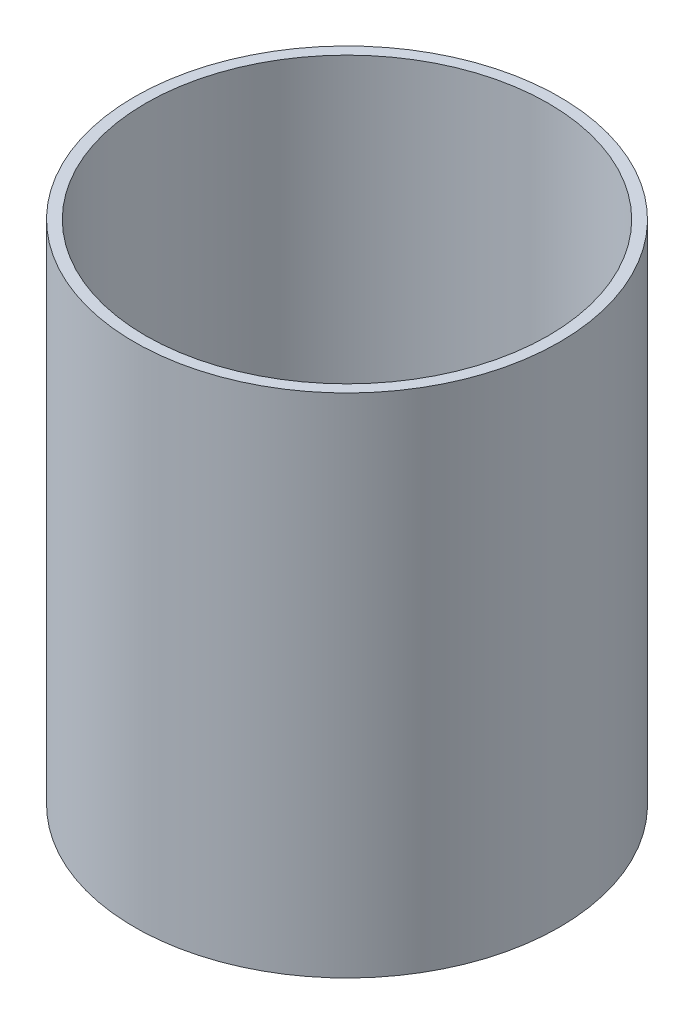
ISO-10303-21;
HEADER;
FILE_DESCRIPTION(('STEP AP214'),'2;1');
FILE_NAME('part.step','',(''),(''),'','','');
FILE_SCHEMA(('AUTOMOTIVE_DESIGN { 1 0 10303 214 1 1 1 1 }'));
ENDSEC;
DATA;
#1=APPLICATION_CONTEXT('core data for automotive mechanical design processes');
#2=APPLICATION_PROTOCOL_DEFINITION('international standard','automotive_design',2000,#1);
#3=PRODUCT_CONTEXT('',#1,'mechanical');
#4=PRODUCT('Part','Part','',(#3));
#5=PRODUCT_RELATED_PRODUCT_CATEGORY('part','',(#4));
#6=PRODUCT_DEFINITION_FORMATION('','',#4);
#7=PRODUCT_DEFINITION_CONTEXT('part definition',#1,'design');
#8=PRODUCT_DEFINITION('design','',#6,#7);
#9=PRODUCT_DEFINITION_SHAPE('','',#8);
#10=(LENGTH_UNIT() NAMED_UNIT(*) SI_UNIT(.MILLI.,.METRE.));
#11=(NAMED_UNIT(*) PLANE_ANGLE_UNIT() SI_UNIT($,.RADIAN.));
#12=(NAMED_UNIT(*) SI_UNIT($,.STERADIAN.) SOLID_ANGLE_UNIT());
#13=UNCERTAINTY_MEASURE_WITH_UNIT(LENGTH_MEASURE(1.E-05),#10,'distance_accuracy_value','');
#14=(GEOMETRIC_REPRESENTATION_CONTEXT(3) GLOBAL_UNCERTAINTY_ASSIGNED_CONTEXT((#13)) GLOBAL_UNIT_ASSIGNED_CONTEXT((#10,
#11,#12)) REPRESENTATION_CONTEXT('',''));
#15=CARTESIAN_POINT('',(0.,0.,0.));
#16=DIRECTION('',(0.,0.,1.));
#17=DIRECTION('',(1.,0.,0.));
#18=AXIS2_PLACEMENT_3D('',#15,#16,#17);
#19=CARTESIAN_POINT('',(0.,150.,0.));
#20=DIRECTION('',(0.,-1.,0.));
#21=DIRECTION('',(1.,0.,0.));
#22=AXIS2_PLACEMENT_3D('',#19,#20,#21);
#23=PLANE('',#22);
#24=CARTESIAN_POINT('',(0.,150.,0.));
#25=DIRECTION('',(0.,-1.,0.));
#26=DIRECTION('',(1.,0.,0.));
#27=AXIS2_PLACEMENT_3D('',#24,#25,#26);
#28=CIRCLE('',#27,190.);
#29=CARTESIAN_POINT('',(190.,150.,0.));
#30=VERTEX_POINT('',#29);
#31=EDGE_CURVE('E72',#30,#30,#28,.T.);
#32=ORIENTED_EDGE('',*,*,#31,.T.);
#33=EDGE_LOOP('',(#32));
#34=FACE_BOUND('',#33,.T.);
#35=CARTESIAN_POINT('',(0.,150.,0.));
#36=DIRECTION('',(0.,-1.,0.));
#37=DIRECTION('',(1.,0.,0.));
#38=AXIS2_PLACEMENT_3D('',#35,#36,#37);
#39=CIRCLE('',#38,180.);
#40=CARTESIAN_POINT('',(180.,150.,0.));
#41=VERTEX_POINT('',#40);
#42=EDGE_CURVE('E60',#41,#41,#39,.F.);
#43=ORIENTED_EDGE('',*,*,#42,.T.);
#44=EDGE_LOOP('',(#43));
#45=FACE_BOUND('',#44,.T.);
#46=ADVANCED_FACE('F56',(#34,#45),#23,.T.);
#47=CARTESIAN_POINT('',(0.,603.,0.));
#48=DIRECTION('',(0.,-1.,0.));
#49=DIRECTION('',(1.,0.,0.));
#50=AXIS2_PLACEMENT_3D('',#47,#48,#49);
#51=PLANE('',#50);
#52=CARTESIAN_POINT('',(1.72279725207947E-13,603.,0.));
#53=DIRECTION('',(0.,1.,0.));
#54=DIRECTION('',(-1.,0.,0.));
#55=AXIS2_PLACEMENT_3D('',#52,#53,#54);
#56=CIRCLE('',#55,180.);
#57=CARTESIAN_POINT('',(-180.,603.,0.));
#58=VERTEX_POINT('',#57);
#59=EDGE_CURVE('E13',#58,#58,#56,.T.);
#60=ORIENTED_EDGE('',*,*,#59,.F.);
#61=EDGE_LOOP('',(#60));
#62=FACE_BOUND('',#61,.T.);
#63=CARTESIAN_POINT('',(1.72279725207947E-13,603.,0.));
#64=DIRECTION('',(0.,1.,0.));
#65=DIRECTION('',(-1.,0.,0.));
#66=AXIS2_PLACEMENT_3D('',#63,#64,#65);
#67=CIRCLE('',#66,190.);
#68=CARTESIAN_POINT('',(-190.,603.,0.));
#69=VERTEX_POINT('',#68);
#70=EDGE_CURVE('E65',#69,#69,#67,.T.);
#71=ORIENTED_EDGE('',*,*,#70,.T.);
#72=EDGE_LOOP('',(#71));
#73=FACE_BOUND('',#72,.T.);
#74=ADVANCED_FACE('F84',(#62,#73),#51,.F.);
#75=CARTESIAN_POINT('',(0.,3.,0.));
#76=DIRECTION('',(0.,1.,0.));
#77=DIRECTION('',(-1.,0.,0.));
#78=AXIS2_PLACEMENT_3D('',#75,#76,#77);
#79=CYLINDRICAL_SURFACE('',#78,180.);
#80=ORIENTED_EDGE('',*,*,#59,.T.);
#81=EDGE_LOOP('',(#80));
#82=FACE_BOUND('',#81,.T.);
#83=ORIENTED_EDGE('',*,*,#42,.F.);
#84=EDGE_LOOP('',(#83));
#85=FACE_BOUND('',#84,.T.);
#86=ADVANCED_FACE('F82',(#82,#85),#79,.F.);
#87=CARTESIAN_POINT('',(0.,3.,0.));
#88=DIRECTION('',(0.,1.,0.));
#89=DIRECTION('',(-1.,0.,0.));
#90=AXIS2_PLACEMENT_3D('',#87,#88,#89);
#91=CYLINDRICAL_SURFACE('',#90,190.);
#92=ORIENTED_EDGE('',*,*,#70,.F.);
#93=EDGE_LOOP('',(#92));
#94=FACE_BOUND('',#93,.T.);
#95=ORIENTED_EDGE('',*,*,#31,.F.);
#96=EDGE_LOOP('',(#95));
#97=FACE_BOUND('',#96,.T.);
#98=ADVANCED_FACE('F58',(#94,#97),#91,.T.);
#99=CLOSED_SHELL('',(#46,#74,#86,#98));
#100=MANIFOLD_SOLID_BREP('B2',#99);
#101=ADVANCED_BREP_SHAPE_REPRESENTATION('',(#18,#100),#14);
#102=SHAPE_DEFINITION_REPRESENTATION(#9,#101);
ENDSEC;
END-ISO-10303-21;
